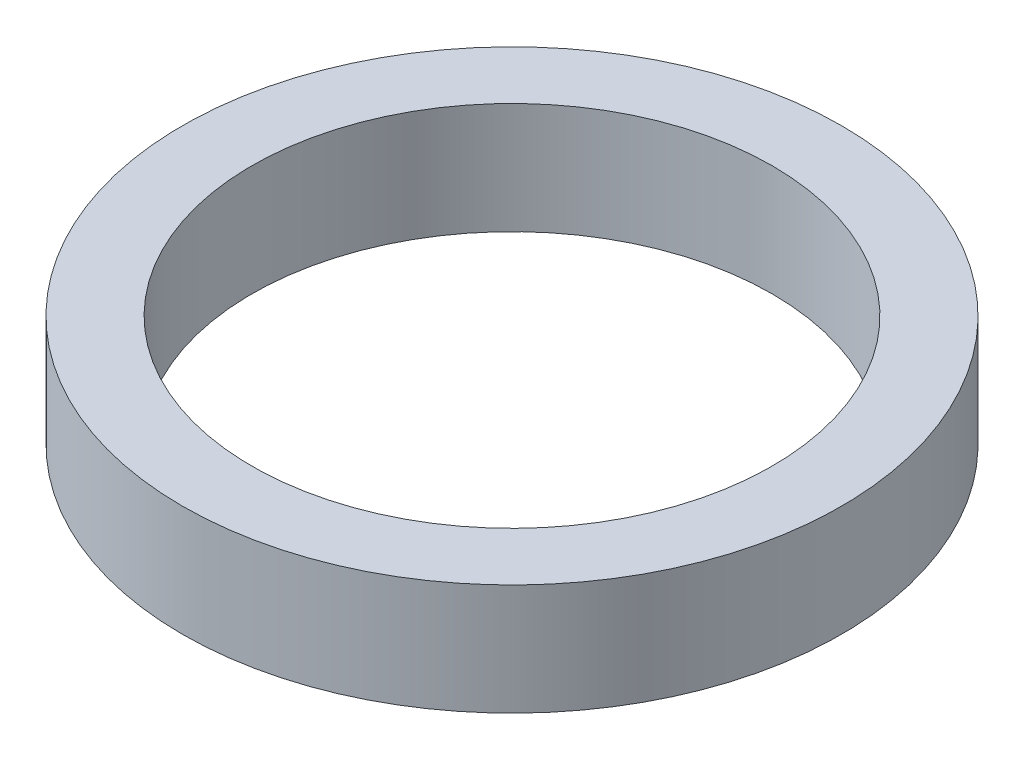
ISO-10303-21;
HEADER;
FILE_DESCRIPTION(('STEP AP214'),'2;1');
FILE_NAME('part.step','',(''),(''),'','','');
FILE_SCHEMA(('AUTOMOTIVE_DESIGN { 1 0 10303 214 1 1 1 1 }'));
ENDSEC;
DATA;
#1=APPLICATION_CONTEXT('core data for automotive mechanical design processes');
#2=APPLICATION_PROTOCOL_DEFINITION('international standard','automotive_design',2000,#1);
#3=PRODUCT_CONTEXT('',#1,'mechanical');
#4=PRODUCT('Part','Part','',(#3));
#5=PRODUCT_RELATED_PRODUCT_CATEGORY('part','',(#4));
#6=PRODUCT_DEFINITION_FORMATION('','',#4);
#7=PRODUCT_DEFINITION_CONTEXT('part definition',#1,'design');
#8=PRODUCT_DEFINITION('design','',#6,#7);
#9=PRODUCT_DEFINITION_SHAPE('','',#8);
#10=(LENGTH_UNIT() NAMED_UNIT(*) SI_UNIT(.MILLI.,.METRE.));
#11=(NAMED_UNIT(*) PLANE_ANGLE_UNIT() SI_UNIT($,.RADIAN.));
#12=(NAMED_UNIT(*) SI_UNIT($,.STERADIAN.) SOLID_ANGLE_UNIT());
#13=UNCERTAINTY_MEASURE_WITH_UNIT(LENGTH_MEASURE(1.E-05),#10,'distance_accuracy_value','');
#14=(GEOMETRIC_REPRESENTATION_CONTEXT(3) GLOBAL_UNCERTAINTY_ASSIGNED_CONTEXT((#13)) GLOBAL_UNIT_ASSIGNED_CONTEXT((#10,
#11,#12)) REPRESENTATION_CONTEXT('',''));
#15=CARTESIAN_POINT('',(0.,0.,0.));
#16=DIRECTION('',(0.,0.,1.));
#17=DIRECTION('',(1.,0.,0.));
#18=AXIS2_PLACEMENT_3D('',#15,#16,#17);
#19=CARTESIAN_POINT('',(0.,10.16,0.));
#20=DIRECTION('',(0.,-1.,0.));
#21=DIRECTION('',(0.,0.,-1.));
#22=AXIS2_PLACEMENT_3D('',#19,#20,#21);
#23=CYLINDRICAL_SURFACE('',#22,30.1625);
#24=CARTESIAN_POINT('',(0.,10.16,0.));
#25=DIRECTION('',(0.,1.,0.));
#26=DIRECTION('',(0.,0.,1.));
#27=AXIS2_PLACEMENT_3D('',#24,#25,#26);
#28=CIRCLE('',#27,30.1625);
#29=CARTESIAN_POINT('',(0.,10.16,30.1625));
#30=VERTEX_POINT('',#29);
#31=EDGE_CURVE('E10',#30,#30,#28,.T.);
#32=ORIENTED_EDGE('',*,*,#31,.F.);
#33=EDGE_LOOP('',(#32));
#34=FACE_BOUND('',#33,.T.);
#35=CARTESIAN_POINT('',(0.,0.,0.));
#36=DIRECTION('',(0.,1.,0.));
#37=DIRECTION('',(0.,0.,1.));
#38=AXIS2_PLACEMENT_3D('',#35,#36,#37);
#39=CIRCLE('',#38,30.1625);
#40=CARTESIAN_POINT('',(0.,0.,30.1625));
#41=VERTEX_POINT('',#40);
#42=EDGE_CURVE('E34',#41,#41,#39,.T.);
#43=ORIENTED_EDGE('',*,*,#42,.T.);
#44=EDGE_LOOP('',(#43));
#45=FACE_BOUND('',#44,.T.);
#46=ADVANCED_FACE('F31',(#34,#45),#23,.T.);
#47=CARTESIAN_POINT('',(0.,10.16,0.));
#48=DIRECTION('',(0.,1.,0.));
#49=DIRECTION('',(0.,0.,1.));
#50=AXIS2_PLACEMENT_3D('',#47,#48,#49);
#51=PLANE('',#50);
#52=CARTESIAN_POINT('',(0.,10.16,0.));
#53=DIRECTION('',(0.,-1.,0.));
#54=DIRECTION('',(0.,0.,-1.));
#55=AXIS2_PLACEMENT_3D('',#52,#53,#54);
#56=CIRCLE('',#55,23.8125);
#57=CARTESIAN_POINT('',(0.,10.16,-23.8125));
#58=VERTEX_POINT('',#57);
#59=EDGE_CURVE('E41',#58,#58,#56,.T.);
#60=ORIENTED_EDGE('',*,*,#59,.T.);
#61=EDGE_LOOP('',(#60));
#62=FACE_BOUND('',#61,.T.);
#63=ORIENTED_EDGE('',*,*,#31,.T.);
#64=EDGE_LOOP('',(#63));
#65=FACE_BOUND('',#64,.T.);
#66=ADVANCED_FACE('F49',(#62,#65),#51,.T.);
#67=CARTESIAN_POINT('',(0.,0.,0.));
#68=DIRECTION('',(0.,1.,0.));
#69=DIRECTION('',(0.,0.,1.));
#70=AXIS2_PLACEMENT_3D('',#67,#68,#69);
#71=PLANE('',#70);
#72=CARTESIAN_POINT('',(0.,0.,0.));
#73=DIRECTION('',(0.,-1.,0.));
#74=DIRECTION('',(0.,0.,-1.));
#75=AXIS2_PLACEMENT_3D('',#72,#73,#74);
#76=CIRCLE('',#75,23.8125);
#77=CARTESIAN_POINT('',(0.,0.,-23.8125));
#78=VERTEX_POINT('',#77);
#79=EDGE_CURVE('E43',#78,#78,#76,.T.);
#80=ORIENTED_EDGE('',*,*,#79,.F.);
#81=EDGE_LOOP('',(#80));
#82=FACE_BOUND('',#81,.T.);
#83=ORIENTED_EDGE('',*,*,#42,.F.);
#84=EDGE_LOOP('',(#83));
#85=FACE_BOUND('',#84,.T.);
#86=ADVANCED_FACE('F54',(#82,#85),#71,.F.);
#87=CARTESIAN_POINT('',(0.,10.16,0.));
#88=DIRECTION('',(0.,-1.,0.));
#89=DIRECTION('',(0.,0.,-1.));
#90=AXIS2_PLACEMENT_3D('',#87,#88,#89);
#91=CYLINDRICAL_SURFACE('',#90,23.8125);
#92=ORIENTED_EDGE('',*,*,#59,.F.);
#93=EDGE_LOOP('',(#92));
#94=FACE_BOUND('',#93,.T.);
#95=ORIENTED_EDGE('',*,*,#79,.T.);
#96=EDGE_LOOP('',(#95));
#97=FACE_BOUND('',#96,.T.);
#98=ADVANCED_FACE('F51',(#94,#97),#91,.F.);
#99=CLOSED_SHELL('',(#46,#66,#86,#98));
#100=MANIFOLD_SOLID_BREP('B2',#99);
#101=ADVANCED_BREP_SHAPE_REPRESENTATION('',(#18,#100),#14);
#102=SHAPE_DEFINITION_REPRESENTATION(#9,#101);
ENDSEC;
END-ISO-10303-21;
